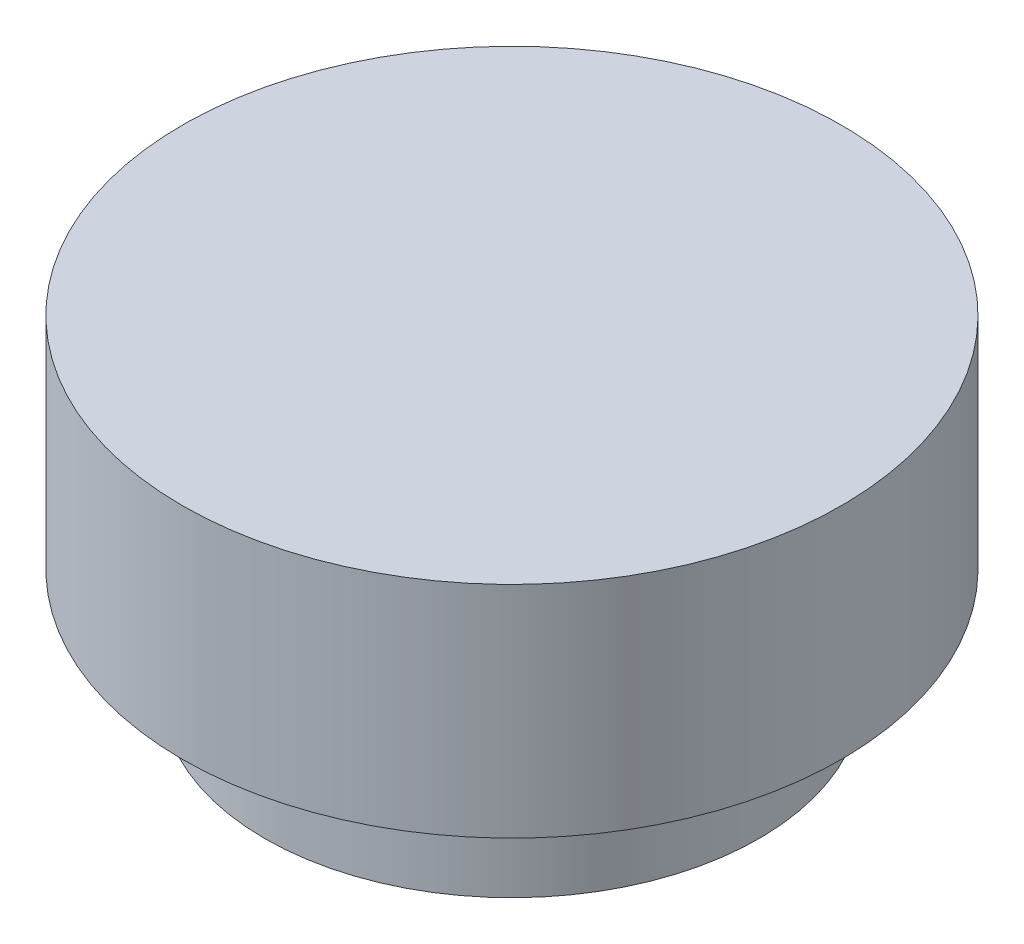
ISO-10303-21;
HEADER;
FILE_DESCRIPTION(('STEP AP214'),'2;1');
FILE_NAME('part.step','',(''),(''),'','','');
FILE_SCHEMA(('AUTOMOTIVE_DESIGN { 1 0 10303 214 1 1 1 1 }'));
ENDSEC;
DATA;
#1=APPLICATION_CONTEXT('core data for automotive mechanical design processes');
#2=APPLICATION_PROTOCOL_DEFINITION('international standard','automotive_design',2000,#1);
#3=PRODUCT_CONTEXT('',#1,'mechanical');
#4=PRODUCT('Part','Part','',(#3));
#5=PRODUCT_RELATED_PRODUCT_CATEGORY('part','',(#4));
#6=PRODUCT_DEFINITION_FORMATION('','',#4);
#7=PRODUCT_DEFINITION_CONTEXT('part definition',#1,'design');
#8=PRODUCT_DEFINITION('design','',#6,#7);
#9=PRODUCT_DEFINITION_SHAPE('','',#8);
#10=(LENGTH_UNIT() NAMED_UNIT(*) SI_UNIT(.MILLI.,.METRE.));
#11=(NAMED_UNIT(*) PLANE_ANGLE_UNIT() SI_UNIT($,.RADIAN.));
#12=(NAMED_UNIT(*) SI_UNIT($,.STERADIAN.) SOLID_ANGLE_UNIT());
#13=UNCERTAINTY_MEASURE_WITH_UNIT(LENGTH_MEASURE(1.E-05),#10,'distance_accuracy_value','');
#14=(GEOMETRIC_REPRESENTATION_CONTEXT(3) GLOBAL_UNCERTAINTY_ASSIGNED_CONTEXT((#13)) GLOBAL_UNIT_ASSIGNED_CONTEXT((#10,
#11,#12)) REPRESENTATION_CONTEXT('',''));
#15=CARTESIAN_POINT('',(0.,0.,0.));
#16=DIRECTION('',(0.,0.,1.));
#17=DIRECTION('',(1.,0.,0.));
#18=AXIS2_PLACEMENT_3D('',#15,#16,#17);
#19=CARTESIAN_POINT('',(0.,10.,0.));
#20=DIRECTION('',(0.,-1.,0.));
#21=DIRECTION('',(0.,0.,-1.));
#22=AXIS2_PLACEMENT_3D('',#19,#20,#21);
#23=CYLINDRICAL_SURFACE('',#22,22.5);
#24=CARTESIAN_POINT('',(0.,10.,0.));
#25=DIRECTION('',(0.,1.,0.));
#26=DIRECTION('',(0.,0.,1.));
#27=AXIS2_PLACEMENT_3D('',#24,#25,#26);
#28=CIRCLE('',#27,22.5);
#29=CARTESIAN_POINT('',(0.,10.,22.5));
#30=VERTEX_POINT('',#29);
#31=EDGE_CURVE('E11',#30,#30,#28,.T.);
#32=ORIENTED_EDGE('',*,*,#31,.F.);
#33=EDGE_LOOP('',(#32));
#34=FACE_BOUND('',#33,.T.);
#35=CARTESIAN_POINT('',(0.,0.,0.));
#36=DIRECTION('',(0.,1.,0.));
#37=DIRECTION('',(0.,0.,1.));
#38=AXIS2_PLACEMENT_3D('',#35,#36,#37);
#39=CIRCLE('',#38,22.5);
#40=CARTESIAN_POINT('',(0.,0.,22.5));
#41=VERTEX_POINT('',#40);
#42=EDGE_CURVE('E42',#41,#41,#39,.T.);
#43=ORIENTED_EDGE('',*,*,#42,.T.);
#44=EDGE_LOOP('',(#43));
#45=FACE_BOUND('',#44,.T.);
#46=ADVANCED_FACE('F39',(#34,#45),#23,.T.);
#47=CARTESIAN_POINT('',(0.,0.,0.));
#48=DIRECTION('',(0.,1.,0.));
#49=DIRECTION('',(0.,0.,1.));
#50=AXIS2_PLACEMENT_3D('',#47,#48,#49);
#51=PLANE('',#50);
#52=CARTESIAN_POINT('',(0.,0.,0.));
#53=DIRECTION('',(0.,-1.,0.));
#54=DIRECTION('',(0.,0.,-1.));
#55=AXIS2_PLACEMENT_3D('',#52,#53,#54);
#56=CIRCLE('',#55,21.5);
#57=CARTESIAN_POINT('',(4.83856503950974,0.,20.9484674465326));
#58=VERTEX_POINT('',#57);
#59=CARTESIAN_POINT('',(-4.83856503950294,0.,20.9484674465341));
#60=VERTEX_POINT('',#59);
#61=EDGE_CURVE('E88',#58,#60,#56,.T.);
#62=ORIENTED_EDGE('',*,*,#61,.F.);
#63=DIRECTION('',(-0.471428571428459,0.,0.881904247660097));
#64=VECTOR('',#63,1.);
#65=CARTESIAN_POINT('',(12.4726457883362,0.,6.66734693877418));
#66=LINE('',#65,#64);
#67=CARTESIAN_POINT('',(14.5514200863916,0.,2.77857142856957));
#68=VERTEX_POINT('',#67);
#69=EDGE_CURVE('E53',#68,#58,#66,.T.);
#70=ORIENTED_EDGE('',*,*,#69,.F.);
#71=CARTESIAN_POINT('',(0.,0.,-5.));
#72=DIRECTION('',(0.,-1.,0.));
#73=DIRECTION('',(0.,0.,-1.));
#74=AXIS2_PLACEMENT_3D('',#71,#72,#73);
#75=CIRCLE('',#74,16.5);
#76=CARTESIAN_POINT('',(-14.5514200863896,0.,2.77857142857328));
#77=VERTEX_POINT('',#76);
#78=EDGE_CURVE('E104',#77,#68,#75,.T.);
#79=ORIENTED_EDGE('',*,*,#78,.F.);
#80=DIRECTION('',(-0.471428571428684,0.,-0.881904247659977));
#81=VECTOR('',#80,1.);
#82=CARTESIAN_POINT('',(-12.4726457883335,0.,6.66734693877684));
#83=LINE('',#82,#81);
#84=EDGE_CURVE('E110',#60,#77,#83,.T.);
#85=ORIENTED_EDGE('',*,*,#84,.F.);
#86=EDGE_LOOP('',(#62,#70,#79,#85));
#87=FACE_BOUND('',#86,.T.);
#88=ORIENTED_EDGE('',*,*,#42,.F.);
#89=EDGE_LOOP('',(#88));
#90=FACE_BOUND('',#89,.T.);
#91=ADVANCED_FACE('F142',(#87,#90),#51,.F.);
#92=CARTESIAN_POINT('',(0.,30.,0.));
#93=DIRECTION('',(0.,-1.,0.));
#94=DIRECTION('',(0.,0.,-1.));
#95=AXIS2_PLACEMENT_3D('',#92,#93,#94);
#96=CYLINDRICAL_SURFACE('',#95,30.);
#97=CARTESIAN_POINT('',(0.,30.,0.));
#98=DIRECTION('',(0.,1.,0.));
#99=DIRECTION('',(0.,0.,1.));
#100=AXIS2_PLACEMENT_3D('',#97,#98,#99);
#101=CIRCLE('',#100,30.);
#102=CARTESIAN_POINT('',(0.,30.,30.));
#103=VERTEX_POINT('',#102);
#104=EDGE_CURVE('E117',#103,#103,#101,.T.);
#105=ORIENTED_EDGE('',*,*,#104,.F.);
#106=EDGE_LOOP('',(#105));
#107=FACE_BOUND('',#106,.T.);
#108=CARTESIAN_POINT('',(0.,10.,0.));
#109=DIRECTION('',(0.,1.,0.));
#110=DIRECTION('',(0.,0.,1.));
#111=AXIS2_PLACEMENT_3D('',#108,#109,#110);
#112=CIRCLE('',#111,30.);
#113=CARTESIAN_POINT('',(0.,10.,30.));
#114=VERTEX_POINT('',#113);
#115=EDGE_CURVE('E114',#114,#114,#112,.T.);
#116=ORIENTED_EDGE('',*,*,#115,.T.);
#117=EDGE_LOOP('',(#116));
#118=FACE_BOUND('',#117,.T.);
#119=ADVANCED_FACE('F123',(#107,#118),#96,.T.);
#120=CARTESIAN_POINT('',(0.,30.,0.));
#121=DIRECTION('',(0.,1.,0.));
#122=DIRECTION('',(0.,0.,1.));
#123=AXIS2_PLACEMENT_3D('',#120,#121,#122);
#124=PLANE('',#123);
#125=ORIENTED_EDGE('',*,*,#104,.T.);
#126=EDGE_LOOP('',(#125));
#127=FACE_BOUND('',#126,.T.);
#128=ADVANCED_FACE('F128',(#127),#124,.T.);
#129=CARTESIAN_POINT('',(0.,10.,0.));
#130=DIRECTION('',(0.,1.,0.));
#131=DIRECTION('',(0.,0.,1.));
#132=AXIS2_PLACEMENT_3D('',#129,#130,#131);
#133=PLANE('',#132);
#134=ORIENTED_EDGE('',*,*,#31,.T.);
#135=EDGE_LOOP('',(#134));
#136=FACE_BOUND('',#135,.T.);
#137=ORIENTED_EDGE('',*,*,#115,.F.);
#138=EDGE_LOOP('',(#137));
#139=FACE_BOUND('',#138,.T.);
#140=ADVANCED_FACE('F125',(#136,#139),#133,.F.);
#141=CARTESIAN_POINT('',(12.4726457883362,5.,6.66734693877418));
#142=DIRECTION('',(0.881904247660097,0.,0.471428571428459));
#143=DIRECTION('',(0.471428571428459,0.,-0.881904247660097));
#144=AXIS2_PLACEMENT_3D('',#141,#142,#143);
#145=PLANE('',#144);
#146=ORIENTED_EDGE('',*,*,#69,.T.);
#147=DIRECTION('',(0.,-1.,0.));
#148=VECTOR('',#147,1.);
#149=CARTESIAN_POINT('',(4.83856503950974,5.,20.9484674465326));
#150=LINE('',#149,#148);
#151=CARTESIAN_POINT('',(4.83856503950974,5.,20.9484674465326));
#152=VERTEX_POINT('',#151);
#153=EDGE_CURVE('E76',#152,#58,#150,.T.);
#154=ORIENTED_EDGE('',*,*,#153,.F.);
#155=DIRECTION('',(-0.471428571428459,0.,0.881904247660097));
#156=VECTOR('',#155,1.);
#157=CARTESIAN_POINT('',(12.4726457883362,5.,6.66734693877418));
#158=LINE('',#157,#156);
#159=CARTESIAN_POINT('',(14.5514200863916,5.,2.77857142856957));
#160=VERTEX_POINT('',#159);
#161=EDGE_CURVE('E102',#160,#152,#158,.T.);
#162=ORIENTED_EDGE('',*,*,#161,.F.);
#163=DIRECTION('',(0.,-1.,0.));
#164=VECTOR('',#163,1.);
#165=CARTESIAN_POINT('',(14.5514200863916,5.,2.77857142856957));
#166=LINE('',#165,#164);
#167=EDGE_CURVE('E61',#160,#68,#166,.T.);
#168=ORIENTED_EDGE('',*,*,#167,.T.);
#169=EDGE_LOOP('',(#146,#154,#162,#168));
#170=FACE_BOUND('',#169,.T.);
#171=ADVANCED_FACE('F127',(#170),#145,.F.);
#172=CARTESIAN_POINT('',(0.,5.,-5.));
#173=DIRECTION('',(0.,-1.,0.));
#174=DIRECTION('',(0.,0.,-1.));
#175=AXIS2_PLACEMENT_3D('',#172,#173,#174);
#176=CYLINDRICAL_SURFACE('',#175,16.5);
#177=ORIENTED_EDGE('',*,*,#78,.T.);
#178=ORIENTED_EDGE('',*,*,#167,.F.);
#179=CARTESIAN_POINT('',(0.,5.,-5.));
#180=DIRECTION('',(0.,-1.,0.));
#181=DIRECTION('',(0.,0.,-1.));
#182=AXIS2_PLACEMENT_3D('',#179,#180,#181);
#183=CIRCLE('',#182,16.5);
#184=CARTESIAN_POINT('',(-14.5514200863896,5.,2.77857142857328));
#185=VERTEX_POINT('',#184);
#186=EDGE_CURVE('E99',#185,#160,#183,.T.);
#187=ORIENTED_EDGE('',*,*,#186,.F.);
#188=DIRECTION('',(0.,-1.,0.));
#189=VECTOR('',#188,1.);
#190=CARTESIAN_POINT('',(-14.5514200863896,5.,2.77857142857328));
#191=LINE('',#190,#189);
#192=EDGE_CURVE('E92',#185,#77,#191,.T.);
#193=ORIENTED_EDGE('',*,*,#192,.T.);
#194=EDGE_LOOP('',(#177,#178,#187,#193));
#195=FACE_BOUND('',#194,.T.);
#196=ADVANCED_FACE('F136',(#195),#176,.F.);
#197=CARTESIAN_POINT('',(-12.4726457883335,5.,6.66734693877684));
#198=DIRECTION('',(-0.881904247659977,0.,0.471428571428684));
#199=DIRECTION('',(0.471428571428684,0.,0.881904247659977));
#200=AXIS2_PLACEMENT_3D('',#197,#198,#199);
#201=PLANE('',#200);
#202=ORIENTED_EDGE('',*,*,#84,.T.);
#203=ORIENTED_EDGE('',*,*,#192,.F.);
#204=DIRECTION('',(-0.471428571428684,0.,-0.881904247659977));
#205=VECTOR('',#204,1.);
#206=CARTESIAN_POINT('',(-12.4726457883335,5.,6.66734693877684));
#207=LINE('',#206,#205);
#208=CARTESIAN_POINT('',(-4.83856503950294,5.,20.9484674465341));
#209=VERTEX_POINT('',#208);
#210=EDGE_CURVE('E95',#209,#185,#207,.T.);
#211=ORIENTED_EDGE('',*,*,#210,.F.);
#212=DIRECTION('',(0.,-1.,0.));
#213=VECTOR('',#212,1.);
#214=CARTESIAN_POINT('',(-4.83856503950294,5.,20.9484674465341));
#215=LINE('',#214,#213);
#216=EDGE_CURVE('E81',#209,#60,#215,.T.);
#217=ORIENTED_EDGE('',*,*,#216,.T.);
#218=EDGE_LOOP('',(#202,#203,#211,#217));
#219=FACE_BOUND('',#218,.T.);
#220=ADVANCED_FACE('F96',(#219),#201,.F.);
#221=CARTESIAN_POINT('',(0.,5.,0.));
#222=DIRECTION('',(0.,-1.,0.));
#223=DIRECTION('',(0.,0.,-1.));
#224=AXIS2_PLACEMENT_3D('',#221,#222,#223);
#225=CYLINDRICAL_SURFACE('',#224,21.5);
#226=ORIENTED_EDGE('',*,*,#61,.T.);
#227=ORIENTED_EDGE('',*,*,#216,.F.);
#228=CARTESIAN_POINT('',(0.,5.,0.));
#229=DIRECTION('',(0.,-1.,0.));
#230=DIRECTION('',(0.,0.,-1.));
#231=AXIS2_PLACEMENT_3D('',#228,#229,#230);
#232=CIRCLE('',#231,21.5);
#233=EDGE_CURVE('E85',#152,#209,#232,.T.);
#234=ORIENTED_EDGE('',*,*,#233,.F.);
#235=ORIENTED_EDGE('',*,*,#153,.T.);
#236=EDGE_LOOP('',(#226,#227,#234,#235));
#237=FACE_BOUND('',#236,.T.);
#238=ADVANCED_FACE('F83',(#237),#225,.F.);
#239=CARTESIAN_POINT('',(0.,5.,0.));
#240=DIRECTION('',(0.,-1.,0.));
#241=DIRECTION('',(0.,0.,-1.));
#242=AXIS2_PLACEMENT_3D('',#239,#240,#241);
#243=PLANE('',#242);
#244=ORIENTED_EDGE('',*,*,#161,.T.);
#245=ORIENTED_EDGE('',*,*,#233,.T.);
#246=ORIENTED_EDGE('',*,*,#210,.T.);
#247=ORIENTED_EDGE('',*,*,#186,.T.);
#248=EDGE_LOOP('',(#244,#245,#246,#247));
#249=FACE_BOUND('',#248,.T.);
#250=ADVANCED_FACE('F101',(#249),#243,.T.);
#251=CLOSED_SHELL('',(#46,#91,#119,#128,#140,#171,#196,#220,#238,#250));
#252=MANIFOLD_SOLID_BREP('B2',#251);
#253=ADVANCED_BREP_SHAPE_REPRESENTATION('',(#18,#252),#14);
#254=SHAPE_DEFINITION_REPRESENTATION(#9,#253);
ENDSEC;
END-ISO-10303-21;
